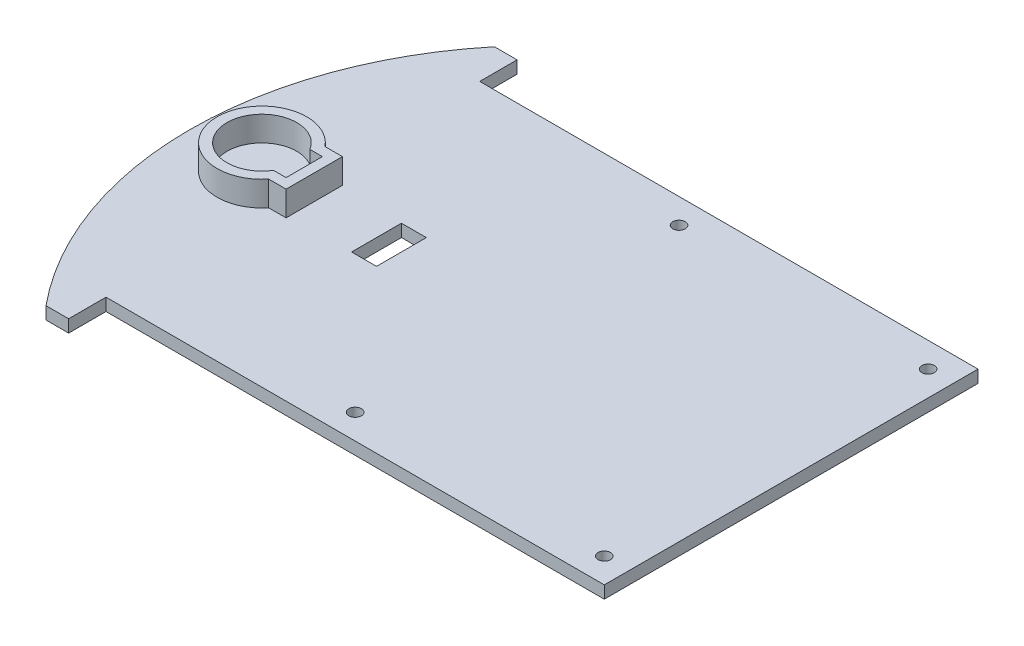
ISO-10303-21;
HEADER;
FILE_DESCRIPTION(('STEP AP214'),'2;1');
FILE_NAME('part.step','',(''),(''),'','','');
FILE_SCHEMA(('AUTOMOTIVE_DESIGN { 1 0 10303 214 1 1 1 1 }'));
ENDSEC;
DATA;
#1=APPLICATION_CONTEXT('core data for automotive mechanical design processes');
#2=APPLICATION_PROTOCOL_DEFINITION('international standard','automotive_design',2000,#1);
#3=PRODUCT_CONTEXT('',#1,'mechanical');
#4=PRODUCT('Part','Part','',(#3));
#5=PRODUCT_RELATED_PRODUCT_CATEGORY('part','',(#4));
#6=PRODUCT_DEFINITION_FORMATION('','',#4);
#7=PRODUCT_DEFINITION_CONTEXT('part definition',#1,'design');
#8=PRODUCT_DEFINITION('design','',#6,#7);
#9=PRODUCT_DEFINITION_SHAPE('','',#8);
#10=(LENGTH_UNIT() NAMED_UNIT(*) SI_UNIT(.MILLI.,.METRE.));
#11=(NAMED_UNIT(*) PLANE_ANGLE_UNIT() SI_UNIT($,.RADIAN.));
#12=(NAMED_UNIT(*) SI_UNIT($,.STERADIAN.) SOLID_ANGLE_UNIT());
#13=UNCERTAINTY_MEASURE_WITH_UNIT(LENGTH_MEASURE(1.E-05),#10,'distance_accuracy_value','');
#14=(GEOMETRIC_REPRESENTATION_CONTEXT(3) GLOBAL_UNCERTAINTY_ASSIGNED_CONTEXT((#13)) GLOBAL_UNIT_ASSIGNED_CONTEXT((#10,
#11,#12)) REPRESENTATION_CONTEXT('',''));
#15=CARTESIAN_POINT('',(0.,0.,0.));
#16=DIRECTION('',(0.,0.,1.));
#17=DIRECTION('',(1.,0.,0.));
#18=AXIS2_PLACEMENT_3D('',#15,#16,#17);
#19=CARTESIAN_POINT('',(0.,5.,0.));
#20=DIRECTION('',(0.,1.,0.));
#21=DIRECTION('',(0.,0.,1.));
#22=AXIS2_PLACEMENT_3D('',#19,#20,#21);
#23=PLANE('',#22);
#24=DIRECTION('',(1.,0.,0.));
#25=VECTOR('',#24,1.);
#26=CARTESIAN_POINT('',(0.,5.,20.3944562899787));
#27=LINE('',#26,#25);
#28=CARTESIAN_POINT('',(-37.6367080496762,5.,20.3944562899787));
#29=VERTEX_POINT('',#28);
#30=CARTESIAN_POINT('',(-27.6367080496762,5.,20.3944562899787));
#31=VERTEX_POINT('',#30);
#32=EDGE_CURVE('E57',#29,#31,#27,.T.);
#33=ORIENTED_EDGE('',*,*,#32,.F.);
#34=DIRECTION('',(0.,0.,-1.));
#35=VECTOR('',#34,1.);
#36=CARTESIAN_POINT('',(-37.6367080496762,5.,0.));
#37=LINE('',#36,#35);
#38=CARTESIAN_POINT('',(-37.6367080496762,5.,0.394456289978664));
#39=VERTEX_POINT('',#38);
#40=EDGE_CURVE('E199',#29,#39,#37,.T.);
#41=ORIENTED_EDGE('',*,*,#40,.T.);
#42=DIRECTION('',(1.,0.,0.));
#43=VECTOR('',#42,1.);
#44=CARTESIAN_POINT('',(0.,5.,0.394456289978664));
#45=LINE('',#44,#43);
#46=CARTESIAN_POINT('',(-27.6367080496762,5.,0.394456289978664));
#47=VERTEX_POINT('',#46);
#48=EDGE_CURVE('E182',#39,#47,#45,.T.);
#49=ORIENTED_EDGE('',*,*,#48,.T.);
#50=DIRECTION('',(0.,0.,-1.));
#51=VECTOR('',#50,1.);
#52=CARTESIAN_POINT('',(-27.6367080496762,5.,0.));
#53=LINE('',#52,#51);
#54=EDGE_CURVE('E192',#31,#47,#53,.T.);
#55=ORIENTED_EDGE('',*,*,#54,.F.);
#56=EDGE_LOOP('',(#33,#41,#49,#55));
#57=FACE_BOUND('',#56,.T.);
#58=CARTESIAN_POINT('',(28.7846481876333,5.,10.3944562899787));
#59=DIRECTION('',(0.,1.,0.));
#60=DIRECTION('',(0.,0.,1.));
#61=AXIS2_PLACEMENT_3D('',#58,#59,#60);
#62=CIRCLE('',#61,141.42135623731);
#63=CARTESIAN_POINT('',(-80.3024729587239,5.,100.394456289979));
#64=VERTEX_POINT('',#63);
#65=CARTESIAN_POINT('',(-80.3024729587239,5.,-79.6055437100213));
#66=VERTEX_POINT('',#65);
#67=EDGE_CURVE('E303',#64,#66,#62,.F.);
#68=ORIENTED_EDGE('',*,*,#67,.F.);
#69=DIRECTION('',(-1.,0.,0.));
#70=VECTOR('',#69,1.);
#71=CARTESIAN_POINT('',(1.53321710917407E-13,5.,100.394456289979));
#72=LINE('',#71,#70);
#73=CARTESIAN_POINT('',(-71.2153518123667,5.,100.394456289979));
#74=VERTEX_POINT('',#73);
#75=EDGE_CURVE('E307',#74,#64,#72,.T.);
#76=ORIENTED_EDGE('',*,*,#75,.F.);
#77=DIRECTION('',(0.,0.,1.));
#78=VECTOR('',#77,1.);
#79=CARTESIAN_POINT('',(-71.2153518123667,5.,0.));
#80=LINE('',#79,#78);
#81=CARTESIAN_POINT('',(-71.2153518123667,5.,85.3944562899787));
#82=VERTEX_POINT('',#81);
#83=EDGE_CURVE('E312',#82,#74,#80,.T.);
#84=ORIENTED_EDGE('',*,*,#83,.F.);
#85=DIRECTION('',(1.,0.,0.));
#86=VECTOR('',#85,1.);
#87=CARTESIAN_POINT('',(0.,5.,85.3944562899787));
#88=LINE('',#87,#86);
#89=CARTESIAN_POINT('',(128.784648187633,5.,85.3944562899787));
#90=VERTEX_POINT('',#89);
#91=EDGE_CURVE('E316',#82,#90,#88,.T.);
#92=ORIENTED_EDGE('',*,*,#91,.T.);
#93=DIRECTION('',(0.,0.,1.));
#94=VECTOR('',#93,1.);
#95=CARTESIAN_POINT('',(128.784648187633,5.,0.));
#96=LINE('',#95,#94);
#97=CARTESIAN_POINT('',(128.784648187633,5.,-64.6055437100213));
#98=VERTEX_POINT('',#97);
#99=EDGE_CURVE('E319',#98,#90,#96,.T.);
#100=ORIENTED_EDGE('',*,*,#99,.F.);
#101=DIRECTION('',(1.,0.,0.));
#102=VECTOR('',#101,1.);
#103=CARTESIAN_POINT('',(0.,5.,-64.6055437100213));
#104=LINE('',#103,#102);
#105=CARTESIAN_POINT('',(-71.2153518123667,5.,-64.6055437100213));
#106=VERTEX_POINT('',#105);
#107=EDGE_CURVE('E323',#106,#98,#104,.T.);
#108=ORIENTED_EDGE('',*,*,#107,.F.);
#109=DIRECTION('',(0.,0.,1.));
#110=VECTOR('',#109,1.);
#111=CARTESIAN_POINT('',(-71.2153518123667,5.,0.));
#112=LINE('',#111,#110);
#113=CARTESIAN_POINT('',(-71.2153518123667,5.,-79.6055437100213));
#114=VERTEX_POINT('',#113);
#115=EDGE_CURVE('E327',#114,#106,#112,.T.);
#116=ORIENTED_EDGE('',*,*,#115,.F.);
#117=DIRECTION('',(-1.,0.,0.));
#118=VECTOR('',#117,1.);
#119=CARTESIAN_POINT('',(0.,5.,-79.6055437100213));
#120=LINE('',#119,#118);
#121=EDGE_CURVE('E331',#114,#66,#120,.T.);
#122=ORIENTED_EDGE('',*,*,#121,.T.);
#123=EDGE_LOOP('',(#68,#76,#84,#92,#100,#108,#116,#122));
#124=FACE_BOUND('',#123,.T.);
#125=CARTESIAN_POINT('',(118.784648187633,5.,75.3944562899787));
#126=DIRECTION('',(0.,1.,0.));
#127=DIRECTION('',(0.,0.,1.));
#128=AXIS2_PLACEMENT_3D('',#125,#126,#127);
#129=CIRCLE('',#128,2.50000000000001);
#130=CARTESIAN_POINT('',(118.784648187633,5.,77.8944562899787));
#131=VERTEX_POINT('',#130);
#132=EDGE_CURVE('E334',#131,#131,#129,.T.);
#133=ORIENTED_EDGE('',*,*,#132,.F.);
#134=EDGE_LOOP('',(#133));
#135=FACE_BOUND('',#134,.T.);
#136=CARTESIAN_POINT('',(118.784648187633,5.,-54.6055437100213));
#137=DIRECTION('',(0.,1.,0.));
#138=DIRECTION('',(0.,0.,1.));
#139=AXIS2_PLACEMENT_3D('',#136,#137,#138);
#140=CIRCLE('',#139,2.50000000000001);
#141=CARTESIAN_POINT('',(118.784648187633,5.,-52.1055437100213));
#142=VERTEX_POINT('',#141);
#143=EDGE_CURVE('E338',#142,#142,#140,.T.);
#144=ORIENTED_EDGE('',*,*,#143,.F.);
#145=EDGE_LOOP('',(#144));
#146=FACE_BOUND('',#145,.T.);
#147=CARTESIAN_POINT('',(18.7846481876333,5.,-54.6055437100213));
#148=DIRECTION('',(0.,1.,0.));
#149=DIRECTION('',(0.,0.,1.));
#150=AXIS2_PLACEMENT_3D('',#147,#148,#149);
#151=CIRCLE('',#150,2.5);
#152=CARTESIAN_POINT('',(18.7846481876333,5.,-52.1055437100213));
#153=VERTEX_POINT('',#152);
#154=EDGE_CURVE('E342',#153,#153,#151,.T.);
#155=ORIENTED_EDGE('',*,*,#154,.F.);
#156=EDGE_LOOP('',(#155));
#157=FACE_BOUND('',#156,.T.);
#158=CARTESIAN_POINT('',(18.7846481876333,5.,75.3944562899787));
#159=DIRECTION('',(0.,1.,0.));
#160=DIRECTION('',(0.,0.,1.));
#161=AXIS2_PLACEMENT_3D('',#158,#159,#160);
#162=CIRCLE('',#161,2.5);
#163=CARTESIAN_POINT('',(18.7846481876333,5.,77.8944562899787));
#164=VERTEX_POINT('',#163);
#165=EDGE_CURVE('E346',#164,#164,#162,.T.);
#166=ORIENTED_EDGE('',*,*,#165,.F.);
#167=EDGE_LOOP('',(#166));
#168=FACE_BOUND('',#167,.T.);
#169=DIRECTION('',(1.,0.,0.));
#170=VECTOR('',#169,1.);
#171=CARTESIAN_POINT('',(0.,5.,21.6944562899787));
#172=LINE('',#171,#170);
#173=CARTESIAN_POINT('',(-69.6256409953794,5.,21.6944562899787));
#174=VERTEX_POINT('',#173);
#175=CARTESIAN_POINT('',(-62.6367080496762,5.,21.6944562899787));
#176=VERTEX_POINT('',#175);
#177=EDGE_CURVE('E264',#174,#176,#172,.T.);
#178=ORIENTED_EDGE('',*,*,#177,.F.);
#179=CARTESIAN_POINT('',(-83.6367080496762,5.,10.3944562899787));
#180=DIRECTION('',(0.,1.,0.));
#181=DIRECTION('',(0.,0.,1.));
#182=AXIS2_PLACEMENT_3D('',#179,#180,#181);
#183=CIRCLE('',#182,18.);
#184=CARTESIAN_POINT('',(-69.6256409953794,5.,-0.905543710021339));
#185=VERTEX_POINT('',#184);
#186=EDGE_CURVE('E260',#185,#174,#183,.T.);
#187=ORIENTED_EDGE('',*,*,#186,.F.);
#188=DIRECTION('',(1.,0.,0.));
#189=VECTOR('',#188,1.);
#190=CARTESIAN_POINT('',(0.,5.,-0.905543710021339));
#191=LINE('',#190,#189);
#192=CARTESIAN_POINT('',(-62.6367080496762,5.,-0.905543710021339));
#193=VERTEX_POINT('',#192);
#194=EDGE_CURVE('E219',#185,#193,#191,.T.);
#195=ORIENTED_EDGE('',*,*,#194,.T.);
#196=DIRECTION('',(0.,0.,-1.));
#197=VECTOR('',#196,1.);
#198=CARTESIAN_POINT('',(-62.6367080496762,5.,0.));
#199=LINE('',#198,#197);
#200=EDGE_CURVE('E268',#176,#193,#199,.T.);
#201=ORIENTED_EDGE('',*,*,#200,.F.);
#202=EDGE_LOOP('',(#178,#187,#195,#201));
#203=FACE_BOUND('',#202,.T.);
#204=ADVANCED_FACE('F41',(#57,#124,#135,#146,#157,#168,#203),#23,.T.);
#205=CARTESIAN_POINT('',(28.7846481876333,5.,10.3944562899787));
#206=DIRECTION('',(0.,-1.,0.));
#207=DIRECTION('',(0.,0.,-1.));
#208=AXIS2_PLACEMENT_3D('',#205,#206,#207);
#209=CYLINDRICAL_SURFACE('',#208,141.42135623731);
#210=CARTESIAN_POINT('',(28.7846481876333,0.,10.3944562899787));
#211=DIRECTION('',(0.,1.,0.));
#212=DIRECTION('',(0.,0.,1.));
#213=AXIS2_PLACEMENT_3D('',#210,#211,#212);
#214=CIRCLE('',#213,141.42135623731);
#215=CARTESIAN_POINT('',(-80.3024729587239,0.,100.394456289979));
#216=VERTEX_POINT('',#215);
#217=CARTESIAN_POINT('',(-80.3024729587239,0.,-79.6055437100213));
#218=VERTEX_POINT('',#217);
#219=EDGE_CURVE('E291',#216,#218,#214,.F.);
#220=ORIENTED_EDGE('',*,*,#219,.F.);
#221=DIRECTION('',(0.,-1.,0.));
#222=VECTOR('',#221,1.);
#223=CARTESIAN_POINT('',(-80.3024729587239,5.,100.394456289979));
#224=LINE('',#223,#222);
#225=EDGE_CURVE('E417',#64,#216,#224,.T.);
#226=ORIENTED_EDGE('',*,*,#225,.F.);
#227=ORIENTED_EDGE('',*,*,#67,.T.);
#228=DIRECTION('',(0.,-1.,0.));
#229=VECTOR('',#228,1.);
#230=CARTESIAN_POINT('',(-80.3024729587239,5.,-79.6055437100213));
#231=LINE('',#230,#229);
#232=EDGE_CURVE('E350',#66,#218,#231,.T.);
#233=ORIENTED_EDGE('',*,*,#232,.T.);
#234=EDGE_LOOP('',(#220,#226,#227,#233));
#235=FACE_BOUND('',#234,.T.);
#236=ADVANCED_FACE('F43',(#235),#209,.T.);
#237=CARTESIAN_POINT('',(1.53321710917407E-13,5.,100.394456289979));
#238=DIRECTION('',(0.,0.,1.));
#239=DIRECTION('',(1.,0.,0.));
#240=AXIS2_PLACEMENT_3D('',#237,#238,#239);
#241=PLANE('',#240);
#242=DIRECTION('',(-1.,0.,0.));
#243=VECTOR('',#242,1.);
#244=CARTESIAN_POINT('',(1.53321710917407E-13,0.,100.394456289979));
#245=LINE('',#244,#243);
#246=CARTESIAN_POINT('',(-71.2153518123667,0.,100.394456289979));
#247=VERTEX_POINT('',#246);
#248=EDGE_CURVE('E354',#247,#216,#245,.T.);
#249=ORIENTED_EDGE('',*,*,#248,.F.);
#250=DIRECTION('',(0.,-1.,0.));
#251=VECTOR('',#250,1.);
#252=CARTESIAN_POINT('',(-71.2153518123667,5.,100.394456289979));
#253=LINE('',#252,#251);
#254=EDGE_CURVE('E414',#74,#247,#253,.T.);
#255=ORIENTED_EDGE('',*,*,#254,.F.);
#256=ORIENTED_EDGE('',*,*,#75,.T.);
#257=ORIENTED_EDGE('',*,*,#225,.T.);
#258=EDGE_LOOP('',(#249,#255,#256,#257));
#259=FACE_BOUND('',#258,.T.);
#260=ADVANCED_FACE('F451',(#259),#241,.T.);
#261=CARTESIAN_POINT('',(-71.2153518123667,5.,0.));
#262=DIRECTION('',(1.,0.,0.));
#263=DIRECTION('',(0.,0.,-1.));
#264=AXIS2_PLACEMENT_3D('',#261,#262,#263);
#265=PLANE('',#264);
#266=DIRECTION('',(0.,0.,1.));
#267=VECTOR('',#266,1.);
#268=CARTESIAN_POINT('',(-71.2153518123667,0.,0.));
#269=LINE('',#268,#267);
#270=CARTESIAN_POINT('',(-71.2153518123667,0.,85.3944562899787));
#271=VERTEX_POINT('',#270);
#272=EDGE_CURVE('E358',#271,#247,#269,.T.);
#273=ORIENTED_EDGE('',*,*,#272,.F.);
#274=DIRECTION('',(0.,-1.,0.));
#275=VECTOR('',#274,1.);
#276=CARTESIAN_POINT('',(-71.2153518123667,5.,85.3944562899787));
#277=LINE('',#276,#275);
#278=EDGE_CURVE('E411',#82,#271,#277,.T.);
#279=ORIENTED_EDGE('',*,*,#278,.F.);
#280=ORIENTED_EDGE('',*,*,#83,.T.);
#281=ORIENTED_EDGE('',*,*,#254,.T.);
#282=EDGE_LOOP('',(#273,#279,#280,#281));
#283=FACE_BOUND('',#282,.T.);
#284=ADVANCED_FACE('F495',(#283),#265,.T.);
#285=CARTESIAN_POINT('',(0.,5.,85.3944562899787));
#286=DIRECTION('',(0.,0.,-1.));
#287=DIRECTION('',(-1.,0.,0.));
#288=AXIS2_PLACEMENT_3D('',#285,#286,#287);
#289=PLANE('',#288);
#290=DIRECTION('',(1.,0.,0.));
#291=VECTOR('',#290,1.);
#292=CARTESIAN_POINT('',(0.,0.,85.3944562899787));
#293=LINE('',#292,#291);
#294=CARTESIAN_POINT('',(128.784648187633,0.,85.3944562899787));
#295=VERTEX_POINT('',#294);
#296=EDGE_CURVE('E362',#271,#295,#293,.T.);
#297=ORIENTED_EDGE('',*,*,#296,.T.);
#298=DIRECTION('',(0.,-1.,0.));
#299=VECTOR('',#298,1.);
#300=CARTESIAN_POINT('',(128.784648187633,5.,85.3944562899787));
#301=LINE('',#300,#299);
#302=EDGE_CURVE('E408',#90,#295,#301,.T.);
#303=ORIENTED_EDGE('',*,*,#302,.F.);
#304=ORIENTED_EDGE('',*,*,#91,.F.);
#305=ORIENTED_EDGE('',*,*,#278,.T.);
#306=EDGE_LOOP('',(#297,#303,#304,#305));
#307=FACE_BOUND('',#306,.T.);
#308=ADVANCED_FACE('F491',(#307),#289,.F.);
#309=CARTESIAN_POINT('',(128.784648187633,5.,0.));
#310=DIRECTION('',(1.,0.,0.));
#311=DIRECTION('',(0.,0.,-1.));
#312=AXIS2_PLACEMENT_3D('',#309,#310,#311);
#313=PLANE('',#312);
#314=DIRECTION('',(0.,0.,1.));
#315=VECTOR('',#314,1.);
#316=CARTESIAN_POINT('',(128.784648187633,0.,0.));
#317=LINE('',#316,#315);
#318=CARTESIAN_POINT('',(128.784648187633,0.,-64.6055437100213));
#319=VERTEX_POINT('',#318);
#320=EDGE_CURVE('E366',#319,#295,#317,.T.);
#321=ORIENTED_EDGE('',*,*,#320,.F.);
#322=DIRECTION('',(0.,-1.,0.));
#323=VECTOR('',#322,1.);
#324=CARTESIAN_POINT('',(128.784648187633,5.,-64.6055437100213));
#325=LINE('',#324,#323);
#326=EDGE_CURVE('E405',#98,#319,#325,.T.);
#327=ORIENTED_EDGE('',*,*,#326,.F.);
#328=ORIENTED_EDGE('',*,*,#99,.T.);
#329=ORIENTED_EDGE('',*,*,#302,.T.);
#330=EDGE_LOOP('',(#321,#327,#328,#329));
#331=FACE_BOUND('',#330,.T.);
#332=ADVANCED_FACE('F487',(#331),#313,.T.);
#333=CARTESIAN_POINT('',(0.,5.,-64.6055437100213));
#334=DIRECTION('',(0.,0.,-1.));
#335=DIRECTION('',(-1.,0.,0.));
#336=AXIS2_PLACEMENT_3D('',#333,#334,#335);
#337=PLANE('',#336);
#338=DIRECTION('',(1.,0.,0.));
#339=VECTOR('',#338,1.);
#340=CARTESIAN_POINT('',(0.,0.,-64.6055437100213));
#341=LINE('',#340,#339);
#342=CARTESIAN_POINT('',(-71.2153518123667,0.,-64.6055437100213));
#343=VERTEX_POINT('',#342);
#344=EDGE_CURVE('E370',#343,#319,#341,.T.);
#345=ORIENTED_EDGE('',*,*,#344,.F.);
#346=DIRECTION('',(0.,-1.,0.));
#347=VECTOR('',#346,1.);
#348=CARTESIAN_POINT('',(-71.2153518123667,5.,-64.6055437100213));
#349=LINE('',#348,#347);
#350=EDGE_CURVE('E402',#106,#343,#349,.T.);
#351=ORIENTED_EDGE('',*,*,#350,.F.);
#352=ORIENTED_EDGE('',*,*,#107,.T.);
#353=ORIENTED_EDGE('',*,*,#326,.T.);
#354=EDGE_LOOP('',(#345,#351,#352,#353));
#355=FACE_BOUND('',#354,.T.);
#356=ADVANCED_FACE('F483',(#355),#337,.T.);
#357=CARTESIAN_POINT('',(-71.2153518123667,5.,0.));
#358=DIRECTION('',(1.,0.,0.));
#359=DIRECTION('',(0.,0.,-1.));
#360=AXIS2_PLACEMENT_3D('',#357,#358,#359);
#361=PLANE('',#360);
#362=DIRECTION('',(0.,0.,1.));
#363=VECTOR('',#362,1.);
#364=CARTESIAN_POINT('',(-71.2153518123667,0.,0.));
#365=LINE('',#364,#363);
#366=CARTESIAN_POINT('',(-71.2153518123667,0.,-79.6055437100213));
#367=VERTEX_POINT('',#366);
#368=EDGE_CURVE('E374',#367,#343,#365,.T.);
#369=ORIENTED_EDGE('',*,*,#368,.F.);
#370=DIRECTION('',(0.,-1.,0.));
#371=VECTOR('',#370,1.);
#372=CARTESIAN_POINT('',(-71.2153518123667,5.,-79.6055437100213));
#373=LINE('',#372,#371);
#374=EDGE_CURVE('E399',#114,#367,#373,.T.);
#375=ORIENTED_EDGE('',*,*,#374,.F.);
#376=ORIENTED_EDGE('',*,*,#115,.T.);
#377=ORIENTED_EDGE('',*,*,#350,.T.);
#378=EDGE_LOOP('',(#369,#375,#376,#377));
#379=FACE_BOUND('',#378,.T.);
#380=ADVANCED_FACE('F469',(#379),#361,.T.);
#381=CARTESIAN_POINT('',(18.7846481876333,5.,-54.6055437100213));
#382=DIRECTION('',(0.,-1.,0.));
#383=DIRECTION('',(0.,0.,-1.));
#384=AXIS2_PLACEMENT_3D('',#381,#382,#383);
#385=CYLINDRICAL_SURFACE('',#384,2.5);
#386=ORIENTED_EDGE('',*,*,#154,.T.);
#387=EDGE_LOOP('',(#386));
#388=FACE_BOUND('',#387,.T.);
#389=CARTESIAN_POINT('',(18.7846481876333,0.,-54.6055437100213));
#390=DIRECTION('',(0.,1.,0.));
#391=DIRECTION('',(0.,0.,1.));
#392=AXIS2_PLACEMENT_3D('',#389,#390,#391);
#393=CIRCLE('',#392,2.5);
#394=CARTESIAN_POINT('',(18.7846481876333,0.,-52.1055437100213));
#395=VERTEX_POINT('',#394);
#396=EDGE_CURVE('E390',#395,#395,#393,.T.);
#397=ORIENTED_EDGE('',*,*,#396,.F.);
#398=EDGE_LOOP('',(#397));
#399=FACE_BOUND('',#398,.T.);
#400=ADVANCED_FACE('F465',(#388,#399),#385,.F.);
#401=CARTESIAN_POINT('',(118.784648187633,5.,-54.6055437100213));
#402=DIRECTION('',(0.,-1.,0.));
#403=DIRECTION('',(0.,0.,-1.));
#404=AXIS2_PLACEMENT_3D('',#401,#402,#403);
#405=CYLINDRICAL_SURFACE('',#404,2.50000000000001);
#406=ORIENTED_EDGE('',*,*,#143,.T.);
#407=EDGE_LOOP('',(#406));
#408=FACE_BOUND('',#407,.T.);
#409=CARTESIAN_POINT('',(118.784648187633,0.,-54.6055437100213));
#410=DIRECTION('',(0.,1.,0.));
#411=DIRECTION('',(0.,0.,1.));
#412=AXIS2_PLACEMENT_3D('',#409,#410,#411);
#413=CIRCLE('',#412,2.50000000000001);
#414=CARTESIAN_POINT('',(118.784648187633,0.,-52.1055437100213));
#415=VERTEX_POINT('',#414);
#416=EDGE_CURVE('E386',#415,#415,#413,.T.);
#417=ORIENTED_EDGE('',*,*,#416,.F.);
#418=EDGE_LOOP('',(#417));
#419=FACE_BOUND('',#418,.T.);
#420=ADVANCED_FACE('F468',(#408,#419),#405,.F.);
#421=CARTESIAN_POINT('',(118.784648187633,5.,75.3944562899787));
#422=DIRECTION('',(0.,-1.,0.));
#423=DIRECTION('',(0.,0.,-1.));
#424=AXIS2_PLACEMENT_3D('',#421,#422,#423);
#425=CYLINDRICAL_SURFACE('',#424,2.50000000000001);
#426=ORIENTED_EDGE('',*,*,#132,.T.);
#427=EDGE_LOOP('',(#426));
#428=FACE_BOUND('',#427,.T.);
#429=CARTESIAN_POINT('',(118.784648187633,0.,75.3944562899787));
#430=DIRECTION('',(0.,1.,0.));
#431=DIRECTION('',(0.,0.,1.));
#432=AXIS2_PLACEMENT_3D('',#429,#430,#431);
#433=CIRCLE('',#432,2.50000000000001);
#434=CARTESIAN_POINT('',(118.784648187633,0.,77.8944562899787));
#435=VERTEX_POINT('',#434);
#436=EDGE_CURVE('E382',#435,#435,#433,.T.);
#437=ORIENTED_EDGE('',*,*,#436,.F.);
#438=EDGE_LOOP('',(#437));
#439=FACE_BOUND('',#438,.T.);
#440=ADVANCED_FACE('F473',(#428,#439),#425,.F.);
#441=CARTESIAN_POINT('',(0.,5.,-79.6055437100213));
#442=DIRECTION('',(0.,0.,1.));
#443=DIRECTION('',(1.,0.,0.));
#444=AXIS2_PLACEMENT_3D('',#441,#442,#443);
#445=PLANE('',#444);
#446=DIRECTION('',(-1.,0.,0.));
#447=VECTOR('',#446,1.);
#448=CARTESIAN_POINT('',(0.,0.,-79.6055437100213));
#449=LINE('',#448,#447);
#450=EDGE_CURVE('E378',#367,#218,#449,.T.);
#451=ORIENTED_EDGE('',*,*,#450,.T.);
#452=ORIENTED_EDGE('',*,*,#232,.F.);
#453=ORIENTED_EDGE('',*,*,#121,.F.);
#454=ORIENTED_EDGE('',*,*,#374,.T.);
#455=EDGE_LOOP('',(#451,#452,#453,#454));
#456=FACE_BOUND('',#455,.T.);
#457=ADVANCED_FACE('F463',(#456),#445,.F.);
#458=CARTESIAN_POINT('',(18.7846481876333,5.,75.3944562899787));
#459=DIRECTION('',(0.,-1.,0.));
#460=DIRECTION('',(0.,0.,-1.));
#461=AXIS2_PLACEMENT_3D('',#458,#459,#460);
#462=CYLINDRICAL_SURFACE('',#461,2.5);
#463=ORIENTED_EDGE('',*,*,#165,.T.);
#464=EDGE_LOOP('',(#463));
#465=FACE_BOUND('',#464,.T.);
#466=CARTESIAN_POINT('',(18.7846481876333,0.,75.3944562899787));
#467=DIRECTION('',(0.,1.,0.));
#468=DIRECTION('',(0.,0.,1.));
#469=AXIS2_PLACEMENT_3D('',#466,#467,#468);
#470=CIRCLE('',#469,2.5);
#471=CARTESIAN_POINT('',(18.7846481876333,0.,77.8944562899787));
#472=VERTEX_POINT('',#471);
#473=EDGE_CURVE('E308',#472,#472,#470,.T.);
#474=ORIENTED_EDGE('',*,*,#473,.F.);
#475=EDGE_LOOP('',(#474));
#476=FACE_BOUND('',#475,.T.);
#477=ADVANCED_FACE('F460',(#465,#476),#462,.F.);
#478=CARTESIAN_POINT('',(0.,0.,0.));
#479=DIRECTION('',(0.,1.,0.));
#480=DIRECTION('',(0.,0.,1.));
#481=AXIS2_PLACEMENT_3D('',#478,#479,#480);
#482=PLANE('',#481);
#483=DIRECTION('',(0.,0.,-1.));
#484=VECTOR('',#483,1.);
#485=CARTESIAN_POINT('',(-37.6367080496762,0.,0.));
#486=LINE('',#485,#484);
#487=CARTESIAN_POINT('',(-37.6367080496762,0.,20.3944562899787));
#488=VERTEX_POINT('',#487);
#489=CARTESIAN_POINT('',(-37.6367080496762,0.,0.394456289978664));
#490=VERTEX_POINT('',#489);
#491=EDGE_CURVE('E50',#488,#490,#486,.T.);
#492=ORIENTED_EDGE('',*,*,#491,.F.);
#493=DIRECTION('',(1.,0.,0.));
#494=VECTOR('',#493,1.);
#495=CARTESIAN_POINT('',(0.,0.,20.3944562899787));
#496=LINE('',#495,#494);
#497=CARTESIAN_POINT('',(-27.6367080496762,0.,20.3944562899787));
#498=VERTEX_POINT('',#497);
#499=EDGE_CURVE('E11',#488,#498,#496,.T.);
#500=ORIENTED_EDGE('',*,*,#499,.T.);
#501=DIRECTION('',(0.,0.,-1.));
#502=VECTOR('',#501,1.);
#503=CARTESIAN_POINT('',(-27.6367080496762,0.,0.));
#504=LINE('',#503,#502);
#505=CARTESIAN_POINT('',(-27.6367080496762,0.,0.394456289978664));
#506=VERTEX_POINT('',#505);
#507=EDGE_CURVE('E420',#498,#506,#504,.T.);
#508=ORIENTED_EDGE('',*,*,#507,.T.);
#509=DIRECTION('',(1.,0.,0.));
#510=VECTOR('',#509,1.);
#511=CARTESIAN_POINT('',(0.,0.,0.394456289978664));
#512=LINE('',#511,#510);
#513=EDGE_CURVE('E185',#490,#506,#512,.T.);
#514=ORIENTED_EDGE('',*,*,#513,.F.);
#515=EDGE_LOOP('',(#492,#500,#508,#514));
#516=FACE_BOUND('',#515,.T.);
#517=ORIENTED_EDGE('',*,*,#219,.T.);
#518=ORIENTED_EDGE('',*,*,#450,.F.);
#519=ORIENTED_EDGE('',*,*,#368,.T.);
#520=ORIENTED_EDGE('',*,*,#344,.T.);
#521=ORIENTED_EDGE('',*,*,#320,.T.);
#522=ORIENTED_EDGE('',*,*,#296,.F.);
#523=ORIENTED_EDGE('',*,*,#272,.T.);
#524=ORIENTED_EDGE('',*,*,#248,.T.);
#525=EDGE_LOOP('',(#517,#518,#519,#520,#521,#522,#523,#524));
#526=FACE_BOUND('',#525,.T.);
#527=ORIENTED_EDGE('',*,*,#436,.T.);
#528=EDGE_LOOP('',(#527));
#529=FACE_BOUND('',#528,.T.);
#530=ORIENTED_EDGE('',*,*,#416,.T.);
#531=EDGE_LOOP('',(#530));
#532=FACE_BOUND('',#531,.T.);
#533=ORIENTED_EDGE('',*,*,#396,.T.);
#534=EDGE_LOOP('',(#533));
#535=FACE_BOUND('',#534,.T.);
#536=ORIENTED_EDGE('',*,*,#473,.T.);
#537=EDGE_LOOP('',(#536));
#538=FACE_BOUND('',#537,.T.);
#539=ADVANCED_FACE('F430',(#516,#526,#529,#532,#535,#538),#482,.F.);
#540=CARTESIAN_POINT('',(-83.6367080496762,15.,10.3944562899787));
#541=DIRECTION('',(0.,-1.,0.));
#542=DIRECTION('',(0.,0.,-1.));
#543=AXIS2_PLACEMENT_3D('',#540,#541,#542);
#544=CYLINDRICAL_SURFACE('',#543,18.);
#545=ORIENTED_EDGE('',*,*,#186,.T.);
#546=DIRECTION('',(0.,-1.,0.));
#547=VECTOR('',#546,1.);
#548=CARTESIAN_POINT('',(-69.6256409953794,15.,21.6944562899787));
#549=LINE('',#548,#547);
#550=CARTESIAN_POINT('',(-69.6256409953794,15.,21.6944562899787));
#551=VERTEX_POINT('',#550);
#552=EDGE_CURVE('E287',#551,#174,#549,.T.);
#553=ORIENTED_EDGE('',*,*,#552,.F.);
#554=CARTESIAN_POINT('',(-83.6367080496762,15.,10.3944562899787));
#555=DIRECTION('',(0.,1.,0.));
#556=DIRECTION('',(0.,0.,1.));
#557=AXIS2_PLACEMENT_3D('',#554,#555,#556);
#558=CIRCLE('',#557,18.);
#559=CARTESIAN_POINT('',(-69.6256409953794,15.,-0.905543710021339));
#560=VERTEX_POINT('',#559);
#561=EDGE_CURVE('E230',#560,#551,#558,.T.);
#562=ORIENTED_EDGE('',*,*,#561,.F.);
#563=DIRECTION('',(0.,-1.,0.));
#564=VECTOR('',#563,1.);
#565=CARTESIAN_POINT('',(-69.6256409953794,15.,-0.905543710021339));
#566=LINE('',#565,#564);
#567=EDGE_CURVE('E274',#560,#185,#566,.T.);
#568=ORIENTED_EDGE('',*,*,#567,.T.);
#569=EDGE_LOOP('',(#545,#553,#562,#568));
#570=FACE_BOUND('',#569,.T.);
#571=ADVANCED_FACE('F459',(#570),#544,.T.);
#572=CARTESIAN_POINT('',(0.,15.,21.6944562899787));
#573=DIRECTION('',(0.,0.,-1.));
#574=DIRECTION('',(-1.,0.,0.));
#575=AXIS2_PLACEMENT_3D('',#572,#573,#574);
#576=PLANE('',#575);
#577=ORIENTED_EDGE('',*,*,#177,.T.);
#578=DIRECTION('',(0.,-1.,0.));
#579=VECTOR('',#578,1.);
#580=CARTESIAN_POINT('',(-62.6367080496762,15.,21.6944562899787));
#581=LINE('',#580,#579);
#582=CARTESIAN_POINT('',(-62.6367080496762,15.,21.6944562899787));
#583=VERTEX_POINT('',#582);
#584=EDGE_CURVE('E283',#583,#176,#581,.T.);
#585=ORIENTED_EDGE('',*,*,#584,.F.);
#586=DIRECTION('',(1.,0.,0.));
#587=VECTOR('',#586,1.);
#588=CARTESIAN_POINT('',(0.,15.,21.6944562899787));
#589=LINE('',#588,#587);
#590=EDGE_CURVE('E234',#551,#583,#589,.T.);
#591=ORIENTED_EDGE('',*,*,#590,.F.);
#592=ORIENTED_EDGE('',*,*,#552,.T.);
#593=EDGE_LOOP('',(#577,#585,#591,#592));
#594=FACE_BOUND('',#593,.T.);
#595=ADVANCED_FACE('F534',(#594),#576,.F.);
#596=CARTESIAN_POINT('',(-62.6367080496762,15.,0.));
#597=DIRECTION('',(-1.,0.,0.));
#598=DIRECTION('',(0.,0.,1.));
#599=AXIS2_PLACEMENT_3D('',#596,#597,#598);
#600=PLANE('',#599);
#601=ORIENTED_EDGE('',*,*,#200,.T.);
#602=DIRECTION('',(0.,-1.,0.));
#603=VECTOR('',#602,1.);
#604=CARTESIAN_POINT('',(-62.6367080496762,15.,-0.905543710021339));
#605=LINE('',#604,#603);
#606=CARTESIAN_POINT('',(-62.6367080496762,15.,-0.905543710021339));
#607=VERTEX_POINT('',#606);
#608=EDGE_CURVE('E278',#607,#193,#605,.T.);
#609=ORIENTED_EDGE('',*,*,#608,.F.);
#610=DIRECTION('',(0.,0.,-1.));
#611=VECTOR('',#610,1.);
#612=CARTESIAN_POINT('',(-62.6367080496762,15.,0.));
#613=LINE('',#612,#611);
#614=EDGE_CURVE('E237',#583,#607,#613,.T.);
#615=ORIENTED_EDGE('',*,*,#614,.F.);
#616=ORIENTED_EDGE('',*,*,#584,.T.);
#617=EDGE_LOOP('',(#601,#609,#615,#616));
#618=FACE_BOUND('',#617,.T.);
#619=ADVANCED_FACE('F544',(#618),#600,.F.);
#620=CARTESIAN_POINT('',(-66.6367080496762,15.,0.));
#621=DIRECTION('',(-1.,0.,0.));
#622=DIRECTION('',(0.,0.,1.));
#623=AXIS2_PLACEMENT_3D('',#620,#621,#622);
#624=PLANE('',#623);
#625=DIRECTION('',(0.,0.,-1.));
#626=VECTOR('',#625,1.);
#627=CARTESIAN_POINT('',(-66.6367080496762,5.,0.));
#628=LINE('',#627,#626);
#629=CARTESIAN_POINT('',(-66.6367080496762,5.,17.6944562899787));
#630=VERTEX_POINT('',#629);
#631=CARTESIAN_POINT('',(-66.6367080496762,5.,3.09445628997866));
#632=VERTEX_POINT('',#631);
#633=EDGE_CURVE('E209',#630,#632,#628,.T.);
#634=ORIENTED_EDGE('',*,*,#633,.F.);
#635=DIRECTION('',(0.,-1.,0.));
#636=VECTOR('',#635,1.);
#637=CARTESIAN_POINT('',(-66.6367080496762,15.,17.6944562899787));
#638=LINE('',#637,#636);
#639=CARTESIAN_POINT('',(-66.6367080496762,15.,17.6944562899787));
#640=VERTEX_POINT('',#639);
#641=EDGE_CURVE('E279',#640,#630,#638,.T.);
#642=ORIENTED_EDGE('',*,*,#641,.F.);
#643=DIRECTION('',(0.,0.,-1.));
#644=VECTOR('',#643,1.);
#645=CARTESIAN_POINT('',(-66.6367080496762,15.,0.));
#646=LINE('',#645,#644);
#647=CARTESIAN_POINT('',(-66.6367080496762,15.,3.09445628997866));
#648=VERTEX_POINT('',#647);
#649=EDGE_CURVE('E214',#640,#648,#646,.T.);
#650=ORIENTED_EDGE('',*,*,#649,.T.);
#651=DIRECTION('',(0.,-1.,0.));
#652=VECTOR('',#651,1.);
#653=CARTESIAN_POINT('',(-66.6367080496762,15.,3.09445628997866));
#654=LINE('',#653,#652);
#655=EDGE_CURVE('E244',#648,#632,#654,.T.);
#656=ORIENTED_EDGE('',*,*,#655,.T.);
#657=EDGE_LOOP('',(#634,#642,#650,#656));
#658=FACE_BOUND('',#657,.T.);
#659=ADVANCED_FACE('F455',(#658),#624,.T.);
#660=CARTESIAN_POINT('',(0.,15.,17.6944562899787));
#661=DIRECTION('',(0.,0.,-1.));
#662=DIRECTION('',(-1.,0.,0.));
#663=AXIS2_PLACEMENT_3D('',#660,#661,#662);
#664=PLANE('',#663);
#665=DIRECTION('',(1.,0.,0.));
#666=VECTOR('',#665,1.);
#667=CARTESIAN_POINT('',(0.,5.,17.6944562899787));
#668=LINE('',#667,#666);
#669=CARTESIAN_POINT('',(-71.6905789695097,5.,17.6944562899787));
#670=VERTEX_POINT('',#669);
#671=EDGE_CURVE('E248',#670,#630,#668,.T.);
#672=ORIENTED_EDGE('',*,*,#671,.F.);
#673=DIRECTION('',(0.,-1.,0.));
#674=VECTOR('',#673,1.);
#675=CARTESIAN_POINT('',(-71.6905789695097,15.,17.6944562899787));
#676=LINE('',#675,#674);
#677=CARTESIAN_POINT('',(-71.6905789695097,15.,17.6944562899787));
#678=VERTEX_POINT('',#677);
#679=EDGE_CURVE('E298',#678,#670,#676,.T.);
#680=ORIENTED_EDGE('',*,*,#679,.F.);
#681=DIRECTION('',(1.,0.,0.));
#682=VECTOR('',#681,1.);
#683=CARTESIAN_POINT('',(0.,15.,17.6944562899787));
#684=LINE('',#683,#682);
#685=EDGE_CURVE('E218',#678,#640,#684,.T.);
#686=ORIENTED_EDGE('',*,*,#685,.T.);
#687=ORIENTED_EDGE('',*,*,#641,.T.);
#688=EDGE_LOOP('',(#672,#680,#686,#687));
#689=FACE_BOUND('',#688,.T.);
#690=ADVANCED_FACE('F566',(#689),#664,.T.);
#691=CARTESIAN_POINT('',(-83.6367080496762,15.,10.3944562899787));
#692=DIRECTION('',(0.,-1.,0.));
#693=DIRECTION('',(0.,0.,-1.));
#694=AXIS2_PLACEMENT_3D('',#691,#692,#693);
#695=CYLINDRICAL_SURFACE('',#694,14.);
#696=CARTESIAN_POINT('',(-83.6367080496762,5.,10.3944562899787));
#697=DIRECTION('',(0.,1.,0.));
#698=DIRECTION('',(0.,0.,1.));
#699=AXIS2_PLACEMENT_3D('',#696,#697,#698);
#700=CIRCLE('',#699,14.);
#701=CARTESIAN_POINT('',(-71.6905789695097,5.,3.09445628997866));
#702=VERTEX_POINT('',#701);
#703=EDGE_CURVE('E252',#702,#670,#700,.T.);
#704=ORIENTED_EDGE('',*,*,#703,.F.);
#705=DIRECTION('',(0.,-1.,0.));
#706=VECTOR('',#705,1.);
#707=CARTESIAN_POINT('',(-71.6905789695097,15.,3.09445628997866));
#708=LINE('',#707,#706);
#709=CARTESIAN_POINT('',(-71.6905789695097,15.,3.09445628997866));
#710=VERTEX_POINT('',#709);
#711=EDGE_CURVE('E294',#710,#702,#708,.T.);
#712=ORIENTED_EDGE('',*,*,#711,.F.);
#713=CARTESIAN_POINT('',(-83.6367080496762,15.,10.3944562899787));
#714=DIRECTION('',(0.,1.,0.));
#715=DIRECTION('',(0.,0.,1.));
#716=AXIS2_PLACEMENT_3D('',#713,#714,#715);
#717=CIRCLE('',#716,14.);
#718=EDGE_CURVE('E223',#710,#678,#717,.T.);
#719=ORIENTED_EDGE('',*,*,#718,.T.);
#720=ORIENTED_EDGE('',*,*,#679,.T.);
#721=EDGE_LOOP('',(#704,#712,#719,#720));
#722=FACE_BOUND('',#721,.T.);
#723=ADVANCED_FACE('F563',(#722),#695,.F.);
#724=CARTESIAN_POINT('',(0.,15.,3.09445628997866));
#725=DIRECTION('',(0.,0.,-1.));
#726=DIRECTION('',(-1.,0.,0.));
#727=AXIS2_PLACEMENT_3D('',#724,#725,#726);
#728=PLANE('',#727);
#729=DIRECTION('',(1.,0.,0.));
#730=VECTOR('',#729,1.);
#731=CARTESIAN_POINT('',(0.,5.,3.09445628997866));
#732=LINE('',#731,#730);
#733=EDGE_CURVE('E256',#702,#632,#732,.T.);
#734=ORIENTED_EDGE('',*,*,#733,.T.);
#735=ORIENTED_EDGE('',*,*,#655,.F.);
#736=DIRECTION('',(1.,0.,0.));
#737=VECTOR('',#736,1.);
#738=CARTESIAN_POINT('',(0.,15.,3.09445628997866));
#739=LINE('',#738,#737);
#740=EDGE_CURVE('E227',#710,#648,#739,.T.);
#741=ORIENTED_EDGE('',*,*,#740,.F.);
#742=ORIENTED_EDGE('',*,*,#711,.T.);
#743=EDGE_LOOP('',(#734,#735,#741,#742));
#744=FACE_BOUND('',#743,.T.);
#745=ADVANCED_FACE('F551',(#744),#728,.F.);
#746=CARTESIAN_POINT('',(0.,15.,-0.905543710021339));
#747=DIRECTION('',(0.,0.,-1.));
#748=DIRECTION('',(-1.,0.,0.));
#749=AXIS2_PLACEMENT_3D('',#746,#747,#748);
#750=PLANE('',#749);
#751=ORIENTED_EDGE('',*,*,#194,.F.);
#752=ORIENTED_EDGE('',*,*,#567,.F.);
#753=DIRECTION('',(1.,0.,0.));
#754=VECTOR('',#753,1.);
#755=CARTESIAN_POINT('',(0.,15.,-0.905543710021339));
#756=LINE('',#755,#754);
#757=EDGE_CURVE('E240',#560,#607,#756,.T.);
#758=ORIENTED_EDGE('',*,*,#757,.T.);
#759=ORIENTED_EDGE('',*,*,#608,.T.);
#760=EDGE_LOOP('',(#751,#752,#758,#759));
#761=FACE_BOUND('',#760,.T.);
#762=ADVANCED_FACE('F540',(#761),#750,.T.);
#763=CARTESIAN_POINT('',(0.,15.,0.));
#764=DIRECTION('',(0.,1.,0.));
#765=DIRECTION('',(0.,0.,1.));
#766=AXIS2_PLACEMENT_3D('',#763,#764,#765);
#767=PLANE('',#766);
#768=ORIENTED_EDGE('',*,*,#649,.F.);
#769=ORIENTED_EDGE('',*,*,#685,.F.);
#770=ORIENTED_EDGE('',*,*,#718,.F.);
#771=ORIENTED_EDGE('',*,*,#740,.T.);
#772=EDGE_LOOP('',(#768,#769,#770,#771));
#773=FACE_BOUND('',#772,.T.);
#774=ORIENTED_EDGE('',*,*,#561,.T.);
#775=ORIENTED_EDGE('',*,*,#590,.T.);
#776=ORIENTED_EDGE('',*,*,#614,.T.);
#777=ORIENTED_EDGE('',*,*,#757,.F.);
#778=EDGE_LOOP('',(#774,#775,#776,#777));
#779=FACE_BOUND('',#778,.T.);
#780=ADVANCED_FACE('F442',(#773,#779),#767,.T.);
#781=ORIENTED_EDGE('',*,*,#633,.T.);
#782=ORIENTED_EDGE('',*,*,#733,.F.);
#783=ORIENTED_EDGE('',*,*,#703,.T.);
#784=ORIENTED_EDGE('',*,*,#671,.T.);
#785=EDGE_LOOP('',(#781,#782,#783,#784));
#786=FACE_BOUND('',#785,.T.);
#787=ADVANCED_FACE('F435',(#786),#23,.T.);
#788=CARTESIAN_POINT('',(0.,-1.,20.3944562899787));
#789=DIRECTION('',(0.,0.,1.));
#790=DIRECTION('',(1.,0.,0.));
#791=AXIS2_PLACEMENT_3D('',#788,#789,#790);
#792=PLANE('',#791);
#793=DIRECTION('',(0.,1.,0.));
#794=VECTOR('',#793,1.);
#795=CARTESIAN_POINT('',(-37.6367080496762,-1.,20.3944562899787));
#796=LINE('',#795,#794);
#797=EDGE_CURVE('E206',#488,#29,#796,.T.);
#798=ORIENTED_EDGE('',*,*,#797,.T.);
#799=ORIENTED_EDGE('',*,*,#32,.T.);
#800=DIRECTION('',(0.,1.,0.));
#801=VECTOR('',#800,1.);
#802=CARTESIAN_POINT('',(-27.6367080496762,-1.,20.3944562899787));
#803=LINE('',#802,#801);
#804=EDGE_CURVE('E189',#498,#31,#803,.T.);
#805=ORIENTED_EDGE('',*,*,#804,.F.);
#806=ORIENTED_EDGE('',*,*,#499,.F.);
#807=EDGE_LOOP('',(#798,#799,#805,#806));
#808=FACE_BOUND('',#807,.T.);
#809=ADVANCED_FACE('F432',(#808),#792,.F.);
#810=CARTESIAN_POINT('',(-37.6367080496762,-1.,0.));
#811=DIRECTION('',(1.,0.,0.));
#812=DIRECTION('',(0.,0.,-1.));
#813=AXIS2_PLACEMENT_3D('',#810,#811,#812);
#814=PLANE('',#813);
#815=ORIENTED_EDGE('',*,*,#491,.T.);
#816=DIRECTION('',(0.,1.,0.));
#817=VECTOR('',#816,1.);
#818=CARTESIAN_POINT('',(-37.6367080496762,-1.,0.394456289978664));
#819=LINE('',#818,#817);
#820=EDGE_CURVE('E188',#490,#39,#819,.T.);
#821=ORIENTED_EDGE('',*,*,#820,.T.);
#822=ORIENTED_EDGE('',*,*,#40,.F.);
#823=ORIENTED_EDGE('',*,*,#797,.F.);
#824=EDGE_LOOP('',(#815,#821,#822,#823));
#825=FACE_BOUND('',#824,.T.);
#826=ADVANCED_FACE('F428',(#825),#814,.T.);
#827=CARTESIAN_POINT('',(0.,-1.,0.394456289978664));
#828=DIRECTION('',(0.,0.,1.));
#829=DIRECTION('',(1.,0.,0.));
#830=AXIS2_PLACEMENT_3D('',#827,#828,#829);
#831=PLANE('',#830);
#832=ORIENTED_EDGE('',*,*,#513,.T.);
#833=DIRECTION('',(0.,1.,0.));
#834=VECTOR('',#833,1.);
#835=CARTESIAN_POINT('',(-27.6367080496762,-1.,0.394456289978664));
#836=LINE('',#835,#834);
#837=EDGE_CURVE('E65',#506,#47,#836,.T.);
#838=ORIENTED_EDGE('',*,*,#837,.T.);
#839=ORIENTED_EDGE('',*,*,#48,.F.);
#840=ORIENTED_EDGE('',*,*,#820,.F.);
#841=EDGE_LOOP('',(#832,#838,#839,#840));
#842=FACE_BOUND('',#841,.T.);
#843=ADVANCED_FACE('F179',(#842),#831,.T.);
#844=CARTESIAN_POINT('',(-27.6367080496762,-1.,0.));
#845=DIRECTION('',(1.,0.,0.));
#846=DIRECTION('',(0.,0.,-1.));
#847=AXIS2_PLACEMENT_3D('',#844,#845,#846);
#848=PLANE('',#847);
#849=ORIENTED_EDGE('',*,*,#804,.T.);
#850=ORIENTED_EDGE('',*,*,#54,.T.);
#851=ORIENTED_EDGE('',*,*,#837,.F.);
#852=ORIENTED_EDGE('',*,*,#507,.F.);
#853=EDGE_LOOP('',(#849,#850,#851,#852));
#854=FACE_BOUND('',#853,.T.);
#855=ADVANCED_FACE('F193',(#854),#848,.F.);
#856=CLOSED_SHELL('',(#204,#236,#260,#284,#308,#332,#356,#380,#400,#420,#440,#457,#477,#539,
#571,#595,#619,#659,#690,#723,#745,#762,#780,#787,#809,#826,#843,#855));
#857=MANIFOLD_SOLID_BREP('B2',#856);
#858=ADVANCED_BREP_SHAPE_REPRESENTATION('',(#18,#857),#14);
#859=SHAPE_DEFINITION_REPRESENTATION(#9,#858);
ENDSEC;
END-ISO-10303-21;
